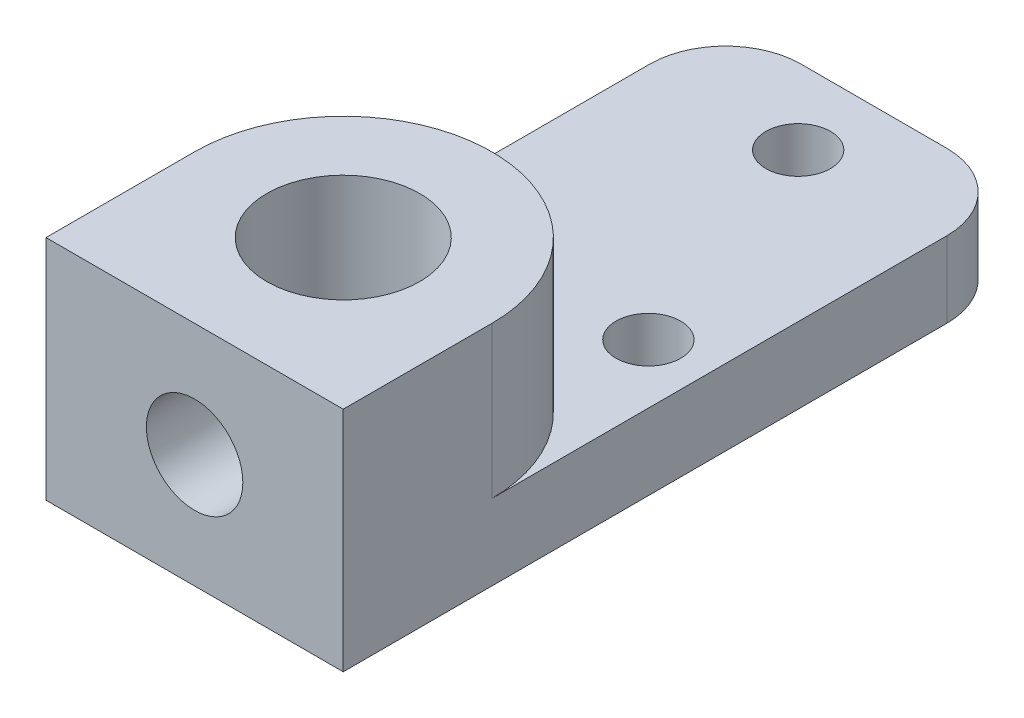
ISO-10303-21;
HEADER;
FILE_DESCRIPTION(('STEP AP214'),'2;1');
FILE_NAME('part.step','',(''),(''),'','','');
FILE_SCHEMA(('AUTOMOTIVE_DESIGN { 1 0 10303 214 1 1 1 1 }'));
ENDSEC;
DATA;
#1=APPLICATION_CONTEXT('core data for automotive mechanical design processes');
#2=APPLICATION_PROTOCOL_DEFINITION('international standard','automotive_design',2000,#1);
#3=PRODUCT_CONTEXT('',#1,'mechanical');
#4=PRODUCT('Part','Part','',(#3));
#5=PRODUCT_RELATED_PRODUCT_CATEGORY('part','',(#4));
#6=PRODUCT_DEFINITION_FORMATION('','',#4);
#7=PRODUCT_DEFINITION_CONTEXT('part definition',#1,'design');
#8=PRODUCT_DEFINITION('design','',#6,#7);
#9=PRODUCT_DEFINITION_SHAPE('','',#8);
#10=(LENGTH_UNIT() NAMED_UNIT(*) SI_UNIT(.MILLI.,.METRE.));
#11=(NAMED_UNIT(*) PLANE_ANGLE_UNIT() SI_UNIT($,.RADIAN.));
#12=(NAMED_UNIT(*) SI_UNIT($,.STERADIAN.) SOLID_ANGLE_UNIT());
#13=UNCERTAINTY_MEASURE_WITH_UNIT(LENGTH_MEASURE(1.E-05),#10,'distance_accuracy_value','');
#14=(GEOMETRIC_REPRESENTATION_CONTEXT(3) GLOBAL_UNCERTAINTY_ASSIGNED_CONTEXT((#13)) GLOBAL_UNIT_ASSIGNED_CONTEXT((#10,
#11,#12)) REPRESENTATION_CONTEXT('',''));
#15=CARTESIAN_POINT('',(0.,0.,0.));
#16=DIRECTION('',(0.,0.,1.));
#17=DIRECTION('',(1.,0.,0.));
#18=AXIS2_PLACEMENT_3D('',#15,#16,#17);
#19=CARTESIAN_POINT('',(-6.223,26.9875,-22.225));
#20=DIRECTION('',(-1.,0.,0.));
#21=DIRECTION('',(0.,0.,1.));
#22=AXIS2_PLACEMENT_3D('',#19,#20,#21);
#23=PLANE('',#22);
#24=DIRECTION('',(0.,0.,1.));
#25=VECTOR('',#24,1.);
#26=CARTESIAN_POINT('',(-6.223,30.1625,-22.225));
#27=LINE('',#26,#25);
#28=CARTESIAN_POINT('',(-6.223,30.1625,-19.05));
#29=VERTEX_POINT('',#28);
#30=CARTESIAN_POINT('',(-6.223,30.1625,0.));
#31=VERTEX_POINT('',#30);
#32=EDGE_CURVE('E101',#29,#31,#27,.T.);
#33=ORIENTED_EDGE('',*,*,#32,.F.);
#34=DIRECTION('',(0.,1.,0.));
#35=VECTOR('',#34,1.);
#36=CARTESIAN_POINT('',(-6.223,26.9875,-19.05));
#37=LINE('',#36,#35);
#38=CARTESIAN_POINT('',(-6.223,26.9875,-19.05));
#39=VERTEX_POINT('',#38);
#40=EDGE_CURVE('E11',#29,#39,#37,.F.);
#41=ORIENTED_EDGE('',*,*,#40,.T.);
#42=DIRECTION('',(0.,0.,1.));
#43=VECTOR('',#42,1.);
#44=CARTESIAN_POINT('',(-6.223,26.9875,-22.225));
#45=LINE('',#44,#43);
#46=CARTESIAN_POINT('',(-6.223,26.9875,6.223));
#47=VERTEX_POINT('',#46);
#48=EDGE_CURVE('E137',#39,#47,#45,.T.);
#49=ORIENTED_EDGE('',*,*,#48,.T.);
#50=DIRECTION('',(0.,1.,0.));
#51=VECTOR('',#50,1.);
#52=CARTESIAN_POINT('',(-6.223,26.9875,6.223));
#53=LINE('',#52,#51);
#54=CARTESIAN_POINT('',(-6.223,36.5125,6.223));
#55=VERTEX_POINT('',#54);
#56=EDGE_CURVE('E146',#47,#55,#53,.T.);
#57=ORIENTED_EDGE('',*,*,#56,.T.);
#58=DIRECTION('',(0.,0.,1.));
#59=VECTOR('',#58,1.);
#60=CARTESIAN_POINT('',(-6.223,36.5125,-22.225));
#61=LINE('',#60,#59);
#62=CARTESIAN_POINT('',(-6.223,36.5125,0.));
#63=VERTEX_POINT('',#62);
#64=EDGE_CURVE('E122',#63,#55,#61,.T.);
#65=ORIENTED_EDGE('',*,*,#64,.F.);
#66=DIRECTION('',(0.,1.,0.));
#67=VECTOR('',#66,1.);
#68=CARTESIAN_POINT('',(-6.223,30.1625,0.));
#69=LINE('',#68,#67);
#70=EDGE_CURVE('E114',#31,#63,#69,.T.);
#71=ORIENTED_EDGE('',*,*,#70,.F.);
#72=EDGE_LOOP('',(#33,#41,#49,#57,#65,#71));
#73=FACE_BOUND('',#72,.T.);
#74=ADVANCED_FACE('F37',(#73),#23,.T.);
#75=CARTESIAN_POINT('',(-6.223,26.9875,6.223));
#76=DIRECTION('',(0.,0.,1.));
#77=DIRECTION('',(1.,0.,0.));
#78=AXIS2_PLACEMENT_3D('',#75,#76,#77);
#79=PLANE('',#78);
#80=CARTESIAN_POINT('',(0.,31.75,6.223));
#81=DIRECTION('',(0.,0.,1.));
#82=DIRECTION('',(1.,0.,0.));
#83=AXIS2_PLACEMENT_3D('',#80,#81,#82);
#84=CIRCLE('',#83,2.01929999999999);
#85=CARTESIAN_POINT('',(2.01929999999999,31.75,6.223));
#86=VERTEX_POINT('',#85);
#87=EDGE_CURVE('E210',#86,#86,#84,.T.);
#88=ORIENTED_EDGE('',*,*,#87,.F.);
#89=EDGE_LOOP('',(#88));
#90=FACE_BOUND('',#89,.T.);
#91=DIRECTION('',(1.,0.,0.));
#92=VECTOR('',#91,1.);
#93=CARTESIAN_POINT('',(-6.223,36.5125,6.223));
#94=LINE('',#93,#92);
#95=CARTESIAN_POINT('',(6.223,36.5125,6.223));
#96=VERTEX_POINT('',#95);
#97=EDGE_CURVE('E124',#55,#96,#94,.T.);
#98=ORIENTED_EDGE('',*,*,#97,.F.);
#99=ORIENTED_EDGE('',*,*,#56,.F.);
#100=DIRECTION('',(1.,0.,0.));
#101=VECTOR('',#100,1.);
#102=CARTESIAN_POINT('',(-6.223,26.9875,6.223));
#103=LINE('',#102,#101);
#104=CARTESIAN_POINT('',(6.223,26.9875,6.223));
#105=VERTEX_POINT('',#104);
#106=EDGE_CURVE('E129',#47,#105,#103,.T.);
#107=ORIENTED_EDGE('',*,*,#106,.T.);
#108=DIRECTION('',(0.,1.,0.));
#109=VECTOR('',#108,1.);
#110=CARTESIAN_POINT('',(6.223,26.9875,6.223));
#111=LINE('',#110,#109);
#112=EDGE_CURVE('E139',#105,#96,#111,.T.);
#113=ORIENTED_EDGE('',*,*,#112,.T.);
#114=EDGE_LOOP('',(#98,#99,#107,#113));
#115=FACE_BOUND('',#114,.T.);
#116=ADVANCED_FACE('F227',(#90,#115),#79,.T.);
#117=CARTESIAN_POINT('',(6.223,26.9875,-22.225));
#118=DIRECTION('',(0.,0.,-1.));
#119=DIRECTION('',(-1.,0.,0.));
#120=AXIS2_PLACEMENT_3D('',#117,#118,#119);
#121=PLANE('',#120);
#122=DIRECTION('',(-1.,0.,0.));
#123=VECTOR('',#122,1.);
#124=CARTESIAN_POINT('',(6.223,30.1625,-22.225));
#125=LINE('',#124,#123);
#126=CARTESIAN_POINT('',(3.048,30.1625,-22.225));
#127=VERTEX_POINT('',#126);
#128=CARTESIAN_POINT('',(-3.048,30.1625,-22.225));
#129=VERTEX_POINT('',#128);
#130=EDGE_CURVE('E110',#127,#129,#125,.T.);
#131=ORIENTED_EDGE('',*,*,#130,.F.);
#132=DIRECTION('',(0.,1.,0.));
#133=VECTOR('',#132,1.);
#134=CARTESIAN_POINT('',(3.048,26.9875,-22.225));
#135=LINE('',#134,#133);
#136=CARTESIAN_POINT('',(3.048,26.9875,-22.225));
#137=VERTEX_POINT('',#136);
#138=EDGE_CURVE('E171',#127,#137,#135,.F.);
#139=ORIENTED_EDGE('',*,*,#138,.T.);
#140=DIRECTION('',(-1.,0.,0.));
#141=VECTOR('',#140,1.);
#142=CARTESIAN_POINT('',(6.223,26.9875,-22.225));
#143=LINE('',#142,#141);
#144=CARTESIAN_POINT('',(-3.048,26.9875,-22.225));
#145=VERTEX_POINT('',#144);
#146=EDGE_CURVE('E135',#137,#145,#143,.T.);
#147=ORIENTED_EDGE('',*,*,#146,.T.);
#148=DIRECTION('',(0.,1.,0.));
#149=VECTOR('',#148,1.);
#150=CARTESIAN_POINT('',(-3.048,26.9875,-22.225));
#151=LINE('',#150,#149);
#152=EDGE_CURVE('E168',#145,#129,#151,.T.);
#153=ORIENTED_EDGE('',*,*,#152,.T.);
#154=EDGE_LOOP('',(#131,#139,#147,#153));
#155=FACE_BOUND('',#154,.T.);
#156=ADVANCED_FACE('F186',(#155),#121,.T.);
#157=CARTESIAN_POINT('',(6.223,26.9875,6.223));
#158=DIRECTION('',(1.,0.,0.));
#159=DIRECTION('',(0.,0.,-1.));
#160=AXIS2_PLACEMENT_3D('',#157,#158,#159);
#161=PLANE('',#160);
#162=DIRECTION('',(0.,0.,-1.));
#163=VECTOR('',#162,1.);
#164=CARTESIAN_POINT('',(6.223,26.9875,6.223));
#165=LINE('',#164,#163);
#166=CARTESIAN_POINT('',(6.223,26.9875,-19.05));
#167=VERTEX_POINT('',#166);
#168=EDGE_CURVE('E132',#105,#167,#165,.T.);
#169=ORIENTED_EDGE('',*,*,#168,.T.);
#170=DIRECTION('',(0.,1.,0.));
#171=VECTOR('',#170,1.);
#172=CARTESIAN_POINT('',(6.223,26.9875,-19.05));
#173=LINE('',#172,#171);
#174=CARTESIAN_POINT('',(6.223,30.1625,-19.05));
#175=VERTEX_POINT('',#174);
#176=EDGE_CURVE('E148',#167,#175,#173,.T.);
#177=ORIENTED_EDGE('',*,*,#176,.T.);
#178=DIRECTION('',(0.,0.,-1.));
#179=VECTOR('',#178,1.);
#180=CARTESIAN_POINT('',(6.223,30.1625,0.));
#181=LINE('',#180,#179);
#182=CARTESIAN_POINT('',(6.223,30.1625,0.));
#183=VERTEX_POINT('',#182);
#184=EDGE_CURVE('E118',#183,#175,#181,.T.);
#185=ORIENTED_EDGE('',*,*,#184,.F.);
#186=DIRECTION('',(0.,1.,0.));
#187=VECTOR('',#186,1.);
#188=CARTESIAN_POINT('',(6.223,30.1625,0.));
#189=LINE('',#188,#187);
#190=CARTESIAN_POINT('',(6.223,36.5125,0.));
#191=VERTEX_POINT('',#190);
#192=EDGE_CURVE('E117',#183,#191,#189,.T.);
#193=ORIENTED_EDGE('',*,*,#192,.T.);
#194=DIRECTION('',(0.,0.,-1.));
#195=VECTOR('',#194,1.);
#196=CARTESIAN_POINT('',(6.223,36.5125,6.223));
#197=LINE('',#196,#195);
#198=EDGE_CURVE('E142',#96,#191,#197,.T.);
#199=ORIENTED_EDGE('',*,*,#198,.F.);
#200=ORIENTED_EDGE('',*,*,#112,.F.);
#201=EDGE_LOOP('',(#169,#177,#185,#193,#199,#200));
#202=FACE_BOUND('',#201,.T.);
#203=ADVANCED_FACE('F181',(#202),#161,.T.);
#204=CARTESIAN_POINT('',(0.,26.9875,0.));
#205=DIRECTION('',(0.,1.,0.));
#206=DIRECTION('',(0.,0.,1.));
#207=AXIS2_PLACEMENT_3D('',#204,#205,#206);
#208=PLANE('',#207);
#209=CARTESIAN_POINT('',(0.,26.9875,0.));
#210=DIRECTION('',(0.,1.,0.));
#211=DIRECTION('',(0.,0.,1.));
#212=AXIS2_PLACEMENT_3D('',#209,#210,#211);
#213=CIRCLE('',#212,3.20039999999999);
#214=CARTESIAN_POINT('',(0.,26.9875,3.20039999999999));
#215=VERTEX_POINT('',#214);
#216=EDGE_CURVE('E196',#215,#215,#213,.T.);
#217=ORIENTED_EDGE('',*,*,#216,.T.);
#218=EDGE_LOOP('',(#217));
#219=FACE_BOUND('',#218,.T.);
#220=CARTESIAN_POINT('',(3.74226128509822,26.9875,-9.03461794842787));
#221=DIRECTION('',(0.,-1.,0.));
#222=DIRECTION('',(0.,0.,-1.));
#223=AXIS2_PLACEMENT_3D('',#220,#221,#222);
#224=CIRCLE('',#223,1.35254999999999);
#225=CARTESIAN_POINT('',(3.74226128509822,26.9875,-10.3871679484279));
#226=VERTEX_POINT('',#225);
#227=EDGE_CURVE('E162',#226,#226,#224,.T.);
#228=ORIENTED_EDGE('',*,*,#227,.F.);
#229=EDGE_LOOP('',(#228));
#230=FACE_BOUND('',#229,.T.);
#231=CARTESIAN_POINT('',(-3.74226128509821,26.9875,-9.03461794842788));
#232=DIRECTION('',(0.,-1.,0.));
#233=DIRECTION('',(0.,0.,-1.));
#234=AXIS2_PLACEMENT_3D('',#231,#232,#233);
#235=CIRCLE('',#234,1.35254999999999);
#236=CARTESIAN_POINT('',(-3.74226128509821,26.9875,-10.3871679484279));
#237=VERTEX_POINT('',#236);
#238=EDGE_CURVE('E158',#237,#237,#235,.T.);
#239=ORIENTED_EDGE('',*,*,#238,.F.);
#240=EDGE_LOOP('',(#239));
#241=FACE_BOUND('',#240,.T.);
#242=CARTESIAN_POINT('',(0.,26.9875,-19.05));
#243=DIRECTION('',(0.,-1.,0.));
#244=DIRECTION('',(0.,0.,-1.));
#245=AXIS2_PLACEMENT_3D('',#242,#243,#244);
#246=CIRCLE('',#245,1.35254999999999);
#247=CARTESIAN_POINT('',(0.,26.9875,-20.40255));
#248=VERTEX_POINT('',#247);
#249=EDGE_CURVE('E154',#248,#248,#246,.T.);
#250=ORIENTED_EDGE('',*,*,#249,.F.);
#251=EDGE_LOOP('',(#250));
#252=FACE_BOUND('',#251,.T.);
#253=ORIENTED_EDGE('',*,*,#146,.F.);
#254=CARTESIAN_POINT('',(3.048,26.9875,-19.05));
#255=DIRECTION('',(0.,1.,0.));
#256=DIRECTION('',(0.,0.,1.));
#257=AXIS2_PLACEMENT_3D('',#254,#255,#256);
#258=CIRCLE('',#257,3.175);
#259=EDGE_CURVE('E45',#137,#167,#258,.F.);
#260=ORIENTED_EDGE('',*,*,#259,.T.);
#261=ORIENTED_EDGE('',*,*,#168,.F.);
#262=ORIENTED_EDGE('',*,*,#106,.F.);
#263=ORIENTED_EDGE('',*,*,#48,.F.);
#264=CARTESIAN_POINT('',(-3.048,26.9875,-19.05));
#265=DIRECTION('',(0.,1.,0.));
#266=DIRECTION('',(0.,0.,1.));
#267=AXIS2_PLACEMENT_3D('',#264,#265,#266);
#268=CIRCLE('',#267,3.175);
#269=EDGE_CURVE('E57',#39,#145,#268,.F.);
#270=ORIENTED_EDGE('',*,*,#269,.T.);
#271=EDGE_LOOP('',(#253,#260,#261,#262,#263,#270));
#272=FACE_BOUND('',#271,.T.);
#273=ADVANCED_FACE('F175',(#219,#230,#241,#252,#272),#208,.F.);
#274=CARTESIAN_POINT('',(0.,36.5125,0.));
#275=DIRECTION('',(0.,1.,0.));
#276=DIRECTION('',(0.,0.,1.));
#277=AXIS2_PLACEMENT_3D('',#274,#275,#276);
#278=PLANE('',#277);
#279=CARTESIAN_POINT('',(0.,36.5125,0.));
#280=DIRECTION('',(0.,1.,0.));
#281=DIRECTION('',(0.,0.,1.));
#282=AXIS2_PLACEMENT_3D('',#279,#280,#281);
#283=CIRCLE('',#282,3.20039999999999);
#284=CARTESIAN_POINT('',(0.,36.5125,3.20039999999999));
#285=VERTEX_POINT('',#284);
#286=EDGE_CURVE('E199',#285,#285,#283,.T.);
#287=ORIENTED_EDGE('',*,*,#286,.F.);
#288=EDGE_LOOP('',(#287));
#289=FACE_BOUND('',#288,.T.);
#290=CARTESIAN_POINT('',(0.,36.5125,0.));
#291=DIRECTION('',(0.,-1.,0.));
#292=DIRECTION('',(0.,0.,-1.));
#293=AXIS2_PLACEMENT_3D('',#290,#291,#292);
#294=CIRCLE('',#293,6.223);
#295=EDGE_CURVE('E153',#63,#191,#294,.T.);
#296=ORIENTED_EDGE('',*,*,#295,.F.);
#297=ORIENTED_EDGE('',*,*,#64,.T.);
#298=ORIENTED_EDGE('',*,*,#97,.T.);
#299=ORIENTED_EDGE('',*,*,#198,.T.);
#300=EDGE_LOOP('',(#296,#297,#298,#299));
#301=FACE_BOUND('',#300,.T.);
#302=ADVANCED_FACE('F236',(#289,#301),#278,.T.);
#303=CARTESIAN_POINT('',(0.,30.1625,0.));
#304=DIRECTION('',(0.,1.,0.));
#305=DIRECTION('',(0.,0.,1.));
#306=AXIS2_PLACEMENT_3D('',#303,#304,#305);
#307=CYLINDRICAL_SURFACE('',#306,6.223);
#308=ORIENTED_EDGE('',*,*,#295,.T.);
#309=ORIENTED_EDGE('',*,*,#192,.F.);
#310=CARTESIAN_POINT('',(0.,30.1625,0.));
#311=DIRECTION('',(0.,-1.,0.));
#312=DIRECTION('',(0.,0.,-1.));
#313=AXIS2_PLACEMENT_3D('',#310,#311,#312);
#314=CIRCLE('',#313,6.223);
#315=EDGE_CURVE('E105',#31,#183,#314,.T.);
#316=ORIENTED_EDGE('',*,*,#315,.F.);
#317=ORIENTED_EDGE('',*,*,#70,.T.);
#318=EDGE_LOOP('',(#308,#309,#316,#317));
#319=FACE_BOUND('',#318,.T.);
#320=ADVANCED_FACE('F113',(#319),#307,.T.);
#321=CARTESIAN_POINT('',(0.,30.1625,0.));
#322=DIRECTION('',(0.,-1.,0.));
#323=DIRECTION('',(0.,0.,-1.));
#324=AXIS2_PLACEMENT_3D('',#321,#322,#323);
#325=PLANE('',#324);
#326=CARTESIAN_POINT('',(3.74226128509822,30.1625,-9.03461794842787));
#327=DIRECTION('',(0.,-1.,0.));
#328=DIRECTION('',(0.,0.,-1.));
#329=AXIS2_PLACEMENT_3D('',#326,#327,#328);
#330=CIRCLE('',#329,1.35254999999999);
#331=CARTESIAN_POINT('',(3.74226128509822,30.1625,-10.3871679484279));
#332=VERTEX_POINT('',#331);
#333=EDGE_CURVE('E159',#332,#332,#330,.T.);
#334=ORIENTED_EDGE('',*,*,#333,.T.);
#335=EDGE_LOOP('',(#334));
#336=FACE_BOUND('',#335,.T.);
#337=CARTESIAN_POINT('',(-3.74226128509821,30.1625,-9.03461794842788));
#338=DIRECTION('',(0.,-1.,0.));
#339=DIRECTION('',(0.,0.,-1.));
#340=AXIS2_PLACEMENT_3D('',#337,#338,#339);
#341=CIRCLE('',#340,1.35254999999999);
#342=CARTESIAN_POINT('',(-3.74226128509821,30.1625,-10.3871679484279));
#343=VERTEX_POINT('',#342);
#344=EDGE_CURVE('E155',#343,#343,#341,.T.);
#345=ORIENTED_EDGE('',*,*,#344,.T.);
#346=EDGE_LOOP('',(#345));
#347=FACE_BOUND('',#346,.T.);
#348=CARTESIAN_POINT('',(0.,30.1625,-19.05));
#349=DIRECTION('',(0.,-1.,0.));
#350=DIRECTION('',(0.,0.,-1.));
#351=AXIS2_PLACEMENT_3D('',#348,#349,#350);
#352=CIRCLE('',#351,1.35254999999999);
#353=CARTESIAN_POINT('',(0.,30.1625,-20.40255));
#354=VERTEX_POINT('',#353);
#355=EDGE_CURVE('E150',#354,#354,#352,.T.);
#356=ORIENTED_EDGE('',*,*,#355,.T.);
#357=EDGE_LOOP('',(#356));
#358=FACE_BOUND('',#357,.T.);
#359=ORIENTED_EDGE('',*,*,#184,.T.);
#360=CARTESIAN_POINT('',(3.048,30.1625,-19.05));
#361=DIRECTION('',(0.,-1.,0.));
#362=DIRECTION('',(0.,0.,-1.));
#363=AXIS2_PLACEMENT_3D('',#360,#361,#362);
#364=CIRCLE('',#363,3.175);
#365=EDGE_CURVE('E166',#175,#127,#364,.F.);
#366=ORIENTED_EDGE('',*,*,#365,.T.);
#367=ORIENTED_EDGE('',*,*,#130,.T.);
#368=CARTESIAN_POINT('',(-3.048,30.1625,-19.05));
#369=DIRECTION('',(0.,-1.,0.));
#370=DIRECTION('',(0.,0.,-1.));
#371=AXIS2_PLACEMENT_3D('',#368,#369,#370);
#372=CIRCLE('',#371,3.175);
#373=EDGE_CURVE('E108',#129,#29,#372,.F.);
#374=ORIENTED_EDGE('',*,*,#373,.T.);
#375=ORIENTED_EDGE('',*,*,#32,.T.);
#376=ORIENTED_EDGE('',*,*,#315,.T.);
#377=EDGE_LOOP('',(#359,#366,#367,#374,#375,#376));
#378=FACE_BOUND('',#377,.T.);
#379=ADVANCED_FACE('F104',(#336,#347,#358,#378),#325,.F.);
#380=CARTESIAN_POINT('',(0.,26.9875,-19.05));
#381=DIRECTION('',(0.,-1.,0.));
#382=DIRECTION('',(0.,0.,-1.));
#383=AXIS2_PLACEMENT_3D('',#380,#381,#382);
#384=CYLINDRICAL_SURFACE('',#383,1.35254999999999);
#385=ORIENTED_EDGE('',*,*,#249,.T.);
#386=EDGE_LOOP('',(#385));
#387=FACE_BOUND('',#386,.T.);
#388=ORIENTED_EDGE('',*,*,#355,.F.);
#389=EDGE_LOOP('',(#388));
#390=FACE_BOUND('',#389,.T.);
#391=ADVANCED_FACE('F255',(#387,#390),#384,.F.);
#392=CARTESIAN_POINT('',(-3.74226128509821,26.9875,-9.03461794842788));
#393=DIRECTION('',(0.,-1.,0.));
#394=DIRECTION('',(0.,0.,-1.));
#395=AXIS2_PLACEMENT_3D('',#392,#393,#394);
#396=CYLINDRICAL_SURFACE('',#395,1.35254999999999);
#397=ORIENTED_EDGE('',*,*,#238,.T.);
#398=EDGE_LOOP('',(#397));
#399=FACE_BOUND('',#398,.T.);
#400=ORIENTED_EDGE('',*,*,#344,.F.);
#401=EDGE_LOOP('',(#400));
#402=FACE_BOUND('',#401,.T.);
#403=ADVANCED_FACE('F259',(#399,#402),#396,.F.);
#404=CARTESIAN_POINT('',(3.74226128509822,26.9875,-9.03461794842787));
#405=DIRECTION('',(0.,-1.,0.));
#406=DIRECTION('',(0.,0.,-1.));
#407=AXIS2_PLACEMENT_3D('',#404,#405,#406);
#408=CYLINDRICAL_SURFACE('',#407,1.35254999999999);
#409=ORIENTED_EDGE('',*,*,#227,.T.);
#410=EDGE_LOOP('',(#409));
#411=FACE_BOUND('',#410,.T.);
#412=ORIENTED_EDGE('',*,*,#333,.F.);
#413=EDGE_LOOP('',(#412));
#414=FACE_BOUND('',#413,.T.);
#415=ADVANCED_FACE('F222',(#411,#414),#408,.F.);
#416=CARTESIAN_POINT('',(0.,36.5125,0.));
#417=DIRECTION('',(0.,1.,0.));
#418=DIRECTION('',(0.,0.,1.));
#419=AXIS2_PLACEMENT_3D('',#416,#417,#418);
#420=CYLINDRICAL_SURFACE('',#419,3.20039999999999);
#421=CARTESIAN_POINT('',(0.,29.7307,3.20039999999999));
#422=CARTESIAN_POINT('',(0.102426583357022,29.7307085274809,3.20039216752008));
#423=CARTESIAN_POINT('',(0.204969532233472,29.738546145515,3.19543155215209));
#424=CARTESIAN_POINT('',(0.406893255974079,29.7694726395662,3.17605687109926));
#425=CARTESIAN_POINT('',(0.506268114409436,29.7925884776539,3.16162609337009));
#426=CARTESIAN_POINT('',(0.698549178517996,29.8527123800774,3.12476047853827));
#427=CARTESIAN_POINT('',(0.791484709200028,29.8896517799751,3.10236522945472));
#428=CARTESIAN_POINT('',(0.969508264298865,29.9759027732827,3.05142582854321));
#429=CARTESIAN_POINT('',(1.05459691673626,30.0252133753929,3.02288216941088));
#430=CARTESIAN_POINT('',(1.2222689454341,30.1391856067665,2.95927216136938));
#431=CARTESIAN_POINT('',(1.30409719331294,30.2047643885607,2.92386546186171));
#432=CARTESIAN_POINT('',(1.45632453000146,30.3472936327874,2.85110749025435));
#433=CARTESIAN_POINT('',(1.52670782179242,30.4242595373991,2.813753622846));
#434=CARTESIAN_POINT('',(1.66397977652826,30.5998539702592,2.7351070389852));
#435=CARTESIAN_POINT('',(1.72903291438482,30.700006413391,2.69398571598336));
#436=CARTESIAN_POINT('',(1.84120618018861,30.912221633887,2.61860624946349));
#437=CARTESIAN_POINT('',(1.8883567983621,31.0242637413455,2.58433648445728));
#438=CARTESIAN_POINT('',(1.95251199193125,31.2271130884652,2.53602575163624));
#439=CARTESIAN_POINT('',(1.97418638383414,31.3157356109831,2.51903387855342));
#440=CARTESIAN_POINT('',(2.00538613310553,31.4963017347268,2.49427273315136));
#441=CARTESIAN_POINT('',(2.01492916531334,31.5882403031719,2.48649004461619));
#442=CARTESIAN_POINT('',(2.02129047876831,31.7731198726362,2.48132352381526));
#443=CARTESIAN_POINT('',(2.0180731097047,31.8660629576134,2.48396882538996));
#444=CARTESIAN_POINT('',(1.99905517814197,32.0498340243674,2.49929525964457));
#445=CARTESIAN_POINT('',(1.9832444042467,32.1406602281261,2.51198453645661));
#446=CARTESIAN_POINT('',(1.94052086452716,32.3155619221534,2.54512016813947));
#447=CARTESIAN_POINT('',(1.91390160314534,32.3997505176949,2.56536037972796));
#448=CARTESIAN_POINT('',(1.85063557949607,32.5626276029879,2.61136642934672));
#449=CARTESIAN_POINT('',(1.81398529400087,32.6413141480229,2.6371342081527));
#450=CARTESIAN_POINT('',(1.72372090542159,32.8068110299111,2.69718493166084));
#451=CARTESIAN_POINT('',(1.66820831369699,32.8923354109523,2.73215618670441));
#452=CARTESIAN_POINT('',(1.54531044054418,33.0538017891706,2.80350437831936));
#453=CARTESIAN_POINT('',(1.47791279738368,33.1297336665816,2.83988274738312));
#454=CARTESIAN_POINT('',(1.31952143137335,33.2831605754816,2.91726870832568));
#455=CARTESIAN_POINT('',(1.22646326193016,33.358688537888,2.95799965784019));
#456=CARTESIAN_POINT('',(1.0266368720281,33.4930020449094,3.03314217416417));
#457=CARTESIAN_POINT('',(0.919873470185374,33.5517934506573,3.06755595174054));
#458=CARTESIAN_POINT('',(0.700821443000145,33.6473522564231,3.12466702250866));
#459=CARTESIAN_POINT('',(0.589097848208682,33.6850953670794,3.14787511201189));
#460=CARTESIAN_POINT('',(0.359075025805126,33.740622186709,3.18230727373433));
#461=CARTESIAN_POINT('',(0.240785743868127,33.7584352638831,3.19354897800934));
#462=CARTESIAN_POINT('',(0.0205280471558571,33.7717412062301,3.20193913706437));
#463=CARTESIAN_POINT('',(-0.0812010984076672,33.7702040214836,3.20096298417362));
#464=CARTESIAN_POINT('',(-0.282732658696343,33.7519648190759,3.18948245121056));
#465=CARTESIAN_POINT('',(-0.382535231325991,33.7352640496781,3.17897885543563));
#466=CARTESIAN_POINT('',(-0.573098988596094,33.6886460483458,3.1500826910212));
#467=CARTESIAN_POINT('',(-0.664064422057216,33.6593281351513,3.13204884804629));
#468=CARTESIAN_POINT('',(-0.839672827769839,33.5888800028702,3.08960807969679));
#469=CARTESIAN_POINT('',(-0.924314774982984,33.5477478739096,3.06520012394763));
#470=CARTESIAN_POINT('',(-1.0940625767136,33.4503273582869,3.0090459925977));
#471=CARTESIAN_POINT('',(-1.17837033176952,33.3929354802254,2.97681036294202));
#472=CARTESIAN_POINT('',(-1.33673496983751,33.2668960522762,2.90914631327962));
#473=CARTESIAN_POINT('',(-1.41078052388216,33.1982362428554,2.87371443486875));
#474=CARTESIAN_POINT('',(-1.55793035475451,33.0398782020588,2.7970108013894));
#475=CARTESIAN_POINT('',(-1.6292647766398,32.9485699481686,2.75565260661658));
#476=CARTESIAN_POINT('',(-1.75589172123331,32.7539298737458,2.67674613818931));
#477=CARTESIAN_POINT('',(-1.81119375394653,32.650605232208,2.63919561455283));
#478=CARTESIAN_POINT('',(-1.894214039773,32.4558945644304,2.58003089677162));
#479=CARTESIAN_POINT('',(-1.92527081256873,32.3664535741489,2.55672702941087));
#480=CARTESIAN_POINT('',(-1.97474412086595,32.1824380128456,2.51871621458894));
#481=CARTESIAN_POINT('',(-1.99318079396746,32.0878718813782,2.50399557665721));
#482=CARTESIAN_POINT('',(-2.01640405705853,31.8953666494754,2.48534006880044));
#483=CARTESIAN_POINT('',(-2.02110528157592,31.7974102675929,2.48147265724461));
#484=CARTESIAN_POINT('',(-2.01624366223405,31.602073729068,2.48542316855157));
#485=CARTESIAN_POINT('',(-2.00667717179118,31.5046937261251,2.4932440787503));
#486=CARTESIAN_POINT('',(-1.97545420322438,31.3222612330733,2.51803101439527));
#487=CARTESIAN_POINT('',(-1.95494800583517,31.2368823964403,2.53412232441194));
#488=CARTESIAN_POINT('',(-1.90365592579247,31.0708652535941,2.57287447914681));
#489=CARTESIAN_POINT('',(-1.87286555724479,30.9902290341657,2.59553819013775));
#490=CARTESIAN_POINT('',(-1.79693245150095,30.8236452755589,2.64877858057743));
#491=CARTESIAN_POINT('',(-1.75037581016552,30.7385592649442,2.68002104323079));
#492=CARTESIAN_POINT('',(-1.64619965714715,30.5765917526763,2.74524537868959));
#493=CARTESIAN_POINT('',(-1.58857138720402,30.4997168218464,2.77922940779404));
#494=CARTESIAN_POINT('',(-1.45005259399193,30.3399369900861,2.8543499406059));
#495=CARTESIAN_POINT('',(-1.36681570213019,30.2590595281976,2.89551574403174));
#496=CARTESIAN_POINT('',(-1.18655023671396,30.1119450481433,2.97394445708673));
#497=CARTESIAN_POINT('',(-1.08951221598808,30.0457181386143,3.01120466264902));
#498=CARTESIAN_POINT('',(-0.882071288985779,29.9296331282858,3.07838473160684));
#499=CARTESIAN_POINT('',(-0.771538368579246,29.8799547995358,3.10822313993439));
#500=CARTESIAN_POINT('',(-0.599038243685197,29.8206391774947,3.14438974634513));
#501=CARTESIAN_POINT('',(-0.540477170392533,29.8034096466682,3.15500773828592));
#502=CARTESIAN_POINT('',(-0.421588048425427,29.7742542524229,3.17307816291595));
#503=CARTESIAN_POINT('',(-0.361261293503958,29.7623246044702,3.18053285427989));
#504=CARTESIAN_POINT('',(-0.250814418500569,29.7457104234151,3.19094522333117));
#505=CARTESIAN_POINT('',(-0.20088723769735,29.7400900315546,3.19448204820722));
#506=CARTESIAN_POINT('',(-0.100649421433256,29.7325826159961,3.19921142928184));
#507=CARTESIAN_POINT('',(-0.0503387638781505,29.730695809068,3.20040384936549));
#508=CARTESIAN_POINT('',(0.,29.7307,3.20039999999999));
#509=B_SPLINE_CURVE_WITH_KNOTS('',3,(#421,#422,#423,#424,#425,#426,#427,#428,#429,#430,#431,
#432,#433,#434,#435,#436,#437,#438,#439,#440,#441,#442,#443,#444,#445,#446,#447,#448,#449,#450,
#451,#452,#453,#454,#455,#456,#457,#458,#459,#460,#461,#462,#463,#464,#465,#466,#467,#468,#469,
#470,#471,#472,#473,#474,#475,#476,#477,#478,#479,#480,#481,#482,#483,#484,#485,#486,#487,#488,
#489,#490,#491,#492,#493,#494,#495,#496,#497,#498,#499,#500,#501,#502,#503,#504,#505,#506,#507,
#508),.UNSPECIFIED.,.T.,.F.,(4,2,2,2,2,2,2,2,2,2,2,2,2,2,2,2,2,2,2,2,2,2,2,2,2,2,2,2,2,2,2,2,2,
2,2,2,2,2,2,2,2,2,2,4),(0.,0.307077599088699,0.614698562106679,0.920811364960777,
1.22689964694386,1.55766688166024,1.88888685555997,2.26600109233658,2.64247014434335,
2.91973194313284,3.196589319372,3.47422073040734,3.75207748907189,4.02284603765099,
4.29370981142475,4.61589928496881,4.93842586834907,5.31628976733208,5.69402117534069,
6.05236079053973,6.41017167068587,6.71383153096587,7.017466396289,7.30804224517991,
7.5986650947291,7.91831615400043,8.23831732844788,8.60579964982126,8.97306354192789,
9.26443530740915,9.55534104707561,9.84805095256678,10.1408356825189,10.4075945070284,
10.6744698424374,10.9790861073169,11.2839443398569,11.65169065596,12.0196899249049,
12.3915655767287,12.5771693185124,12.7626403107293,12.9135484914658,13.0644654335931),.UNSPECIFIED.);
#510=CARTESIAN_POINT('',(0.,29.7307,3.20039999999999));
#511=VERTEX_POINT('',#510);
#512=EDGE_CURVE('E202',#511,#511,#509,.T.);
#513=ORIENTED_EDGE('',*,*,#512,.T.);
#514=EDGE_LOOP('',(#513));
#515=FACE_BOUND('',#514,.T.);
#516=ORIENTED_EDGE('',*,*,#216,.F.);
#517=EDGE_LOOP('',(#516));
#518=FACE_BOUND('',#517,.T.);
#519=ORIENTED_EDGE('',*,*,#286,.T.);
#520=EDGE_LOOP('',(#519));
#521=FACE_BOUND('',#520,.T.);
#522=ADVANCED_FACE('F216',(#515,#518,#521),#420,.F.);
#523=CARTESIAN_POINT('',(0.,31.75,6.223));
#524=DIRECTION('',(0.,0.,1.));
#525=DIRECTION('',(1.,0.,0.));
#526=AXIS2_PLACEMENT_3D('',#523,#524,#525);
#527=CYLINDRICAL_SURFACE('',#526,2.01929999999999);
#528=ORIENTED_EDGE('',*,*,#512,.F.);
#529=EDGE_LOOP('',(#528));
#530=FACE_BOUND('',#529,.T.);
#531=ORIENTED_EDGE('',*,*,#87,.T.);
#532=EDGE_LOOP('',(#531));
#533=FACE_BOUND('',#532,.T.);
#534=ADVANCED_FACE('F213',(#530,#533),#527,.F.);
#535=CARTESIAN_POINT('',(3.048,26.9875,-19.05));
#536=DIRECTION('',(0.,1.,0.));
#537=DIRECTION('',(0.,0.,1.));
#538=AXIS2_PLACEMENT_3D('',#535,#536,#537);
#539=CYLINDRICAL_SURFACE('',#538,3.175);
#540=ORIENTED_EDGE('',*,*,#259,.F.);
#541=ORIENTED_EDGE('',*,*,#138,.F.);
#542=ORIENTED_EDGE('',*,*,#365,.F.);
#543=ORIENTED_EDGE('',*,*,#176,.F.);
#544=EDGE_LOOP('',(#540,#541,#542,#543));
#545=FACE_BOUND('',#544,.T.);
#546=ADVANCED_FACE('F183',(#545),#539,.T.);
#547=CARTESIAN_POINT('',(-3.048,26.9875,-19.05));
#548=DIRECTION('',(0.,1.,0.));
#549=DIRECTION('',(0.,0.,1.));
#550=AXIS2_PLACEMENT_3D('',#547,#548,#549);
#551=CYLINDRICAL_SURFACE('',#550,3.175);
#552=ORIENTED_EDGE('',*,*,#269,.F.);
#553=ORIENTED_EDGE('',*,*,#40,.F.);
#554=ORIENTED_EDGE('',*,*,#373,.F.);
#555=ORIENTED_EDGE('',*,*,#152,.F.);
#556=EDGE_LOOP('',(#552,#553,#554,#555));
#557=FACE_BOUND('',#556,.T.);
#558=ADVANCED_FACE('F39',(#557),#551,.T.);
#559=CLOSED_SHELL('',(#74,#116,#156,#203,#273,#302,#320,#379,#391,#403,#415,#522,#534,#546,#558));
#560=MANIFOLD_SOLID_BREP('B2',#559);
#561=ADVANCED_BREP_SHAPE_REPRESENTATION('',(#18,#560),#14);
#562=SHAPE_DEFINITION_REPRESENTATION(#9,#561);
ENDSEC;
END-ISO-10303-21;
